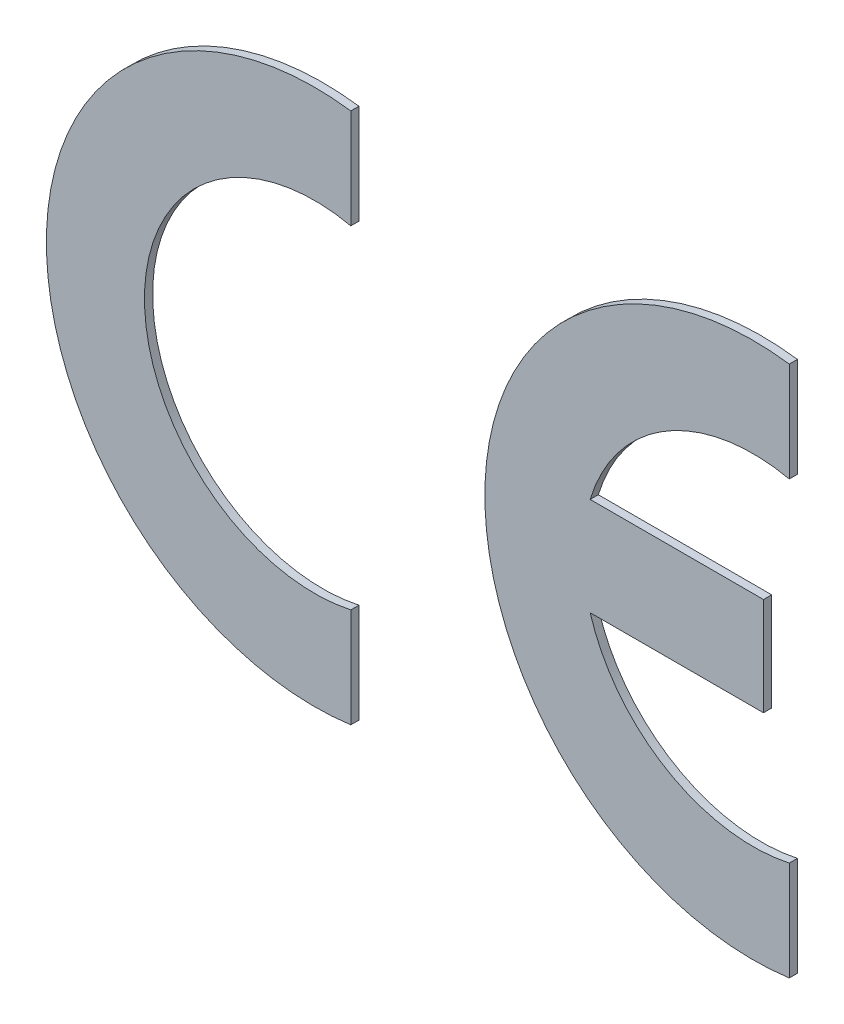
ISO-10303-21;
HEADER;
FILE_DESCRIPTION(('STEP AP214'),'2;1');
FILE_NAME('part.step','',(''),(''),'','','');
FILE_SCHEMA(('AUTOMOTIVE_DESIGN { 1 0 10303 214 1 1 1 1 }'));
ENDSEC;
DATA;
#1=APPLICATION_CONTEXT('core data for automotive mechanical design processes');
#2=APPLICATION_PROTOCOL_DEFINITION('international standard','automotive_design',2000,#1);
#3=PRODUCT_CONTEXT('',#1,'mechanical');
#4=PRODUCT('Part','Part','',(#3));
#5=PRODUCT_RELATED_PRODUCT_CATEGORY('part','',(#4));
#6=PRODUCT_DEFINITION_FORMATION('','',#4);
#7=PRODUCT_DEFINITION_CONTEXT('part definition',#1,'design');
#8=PRODUCT_DEFINITION('design','',#6,#7);
#9=PRODUCT_DEFINITION_SHAPE('','',#8);
#10=(LENGTH_UNIT() NAMED_UNIT(*) SI_UNIT(.MILLI.,.METRE.));
#11=(NAMED_UNIT(*) PLANE_ANGLE_UNIT() SI_UNIT($,.RADIAN.));
#12=(NAMED_UNIT(*) SI_UNIT($,.STERADIAN.) SOLID_ANGLE_UNIT());
#13=UNCERTAINTY_MEASURE_WITH_UNIT(LENGTH_MEASURE(1.E-05),#10,'distance_accuracy_value','');
#14=(GEOMETRIC_REPRESENTATION_CONTEXT(3) GLOBAL_UNCERTAINTY_ASSIGNED_CONTEXT((#13)) GLOBAL_UNIT_ASSIGNED_CONTEXT((#10,
#11,#12)) REPRESENTATION_CONTEXT('',''));
#15=CARTESIAN_POINT('',(0.,0.,0.));
#16=DIRECTION('',(0.,0.,1.));
#17=DIRECTION('',(1.,0.,0.));
#18=AXIS2_PLACEMENT_3D('',#15,#16,#17);
#19=CARTESIAN_POINT('',(0.,0.,0.05));
#20=DIRECTION('',(0.,0.,1.));
#21=DIRECTION('',(1.,0.,0.));
#22=AXIS2_PLACEMENT_3D('',#19,#20,#21);
#23=PLANE('',#22);
#24=DIRECTION('',(0.,1.,0.));
#25=VECTOR('',#24,1.);
#26=CARTESIAN_POINT('',(-0.546694,1.047073831881,0.05));
#27=LINE('',#26,#25);
#28=CARTESIAN_POINT('',(-0.546694,1.047073831881,0.05));
#29=VERTEX_POINT('',#28);
#30=CARTESIAN_POINT('',(-0.546694,1.657166865179,0.05));
#31=VERTEX_POINT('',#30);
#32=EDGE_CURVE('P0_E11',#29,#31,#27,.T.);
#33=ORIENTED_EDGE('',*,*,#32,.T.);
#34=CARTESIAN_POINT('',(-0.7682893867849,0.0277175,0.05));
#35=DIRECTION('',(0.,0.,1.));
#36=DIRECTION('',(0.134753646997806,0.990879132195643,0.));
#37=AXIS2_PLACEMENT_3D('',#34,#35,#36);
#38=CIRCLE('',#37,1.644448159452);
#39=CARTESIAN_POINT('',(-0.546694,-1.601731865179,0.05));
#40=VERTEX_POINT('',#39);
#41=EDGE_CURVE('P0_E83',#31,#40,#38,.T.);
#42=ORIENTED_EDGE('',*,*,#41,.T.);
#43=DIRECTION('',(0.,1.,0.));
#44=VECTOR('',#43,1.);
#45=CARTESIAN_POINT('',(-0.546694,-1.601731865179,0.05));
#46=LINE('',#45,#44);
#47=CARTESIAN_POINT('',(-0.546694,-0.9916378318808,0.05));
#48=VERTEX_POINT('',#47);
#49=EDGE_CURVE('P0_E21',#40,#48,#46,.T.);
#50=ORIENTED_EDGE('',*,*,#49,.T.);
#51=CARTESIAN_POINT('',(-0.7682882978671,0.027718,0.05));
#52=DIRECTION('',(0.,0.,-1.));
#53=DIRECTION('',(0.212425254228403,-0.977177318282613,0.));
#54=AXIS2_PLACEMENT_3D('',#51,#52,#53);
#55=CIRCLE('',#54,1.043163623233);
#56=EDGE_CURVE('P0_E101',#48,#29,#55,.T.);
#57=ORIENTED_EDGE('',*,*,#56,.T.);
#58=EDGE_LOOP('',(#33,#42,#50,#57));
#59=FACE_BOUND('',#58,.T.);
#60=ADVANCED_FACE('P0_F17',(#59),#23,.T.);
#61=CARTESIAN_POINT('',(-0.546694,1.047073831881,0.));
#62=DIRECTION('',(1.,0.,0.));
#63=DIRECTION('',(0.,1.,0.));
#64=AXIS2_PLACEMENT_3D('',#61,#62,#63);
#65=PLANE('',#64);
#66=DIRECTION('',(0.,0.,1.));
#67=VECTOR('',#66,1.);
#68=CARTESIAN_POINT('',(-0.546694,1.657166865179,0.));
#69=LINE('',#68,#67);
#70=CARTESIAN_POINT('',(-0.546694,1.657166865179,0.));
#71=VERTEX_POINT('',#70);
#72=EDGE_CURVE('P0_E28',#71,#31,#69,.T.);
#73=ORIENTED_EDGE('',*,*,#72,.T.);
#74=ORIENTED_EDGE('',*,*,#32,.F.);
#75=DIRECTION('',(0.,0.,1.));
#76=VECTOR('',#75,1.);
#77=CARTESIAN_POINT('',(-0.546694,1.047073831881,0.));
#78=LINE('',#77,#76);
#79=CARTESIAN_POINT('',(-0.546694,1.047073831881,0.));
#80=VERTEX_POINT('',#79);
#81=EDGE_CURVE('P0_E104',#80,#29,#78,.T.);
#82=ORIENTED_EDGE('',*,*,#81,.F.);
#83=DIRECTION('',(0.,1.,0.));
#84=VECTOR('',#83,1.);
#85=CARTESIAN_POINT('',(-0.546694,1.047073831881,0.));
#86=LINE('',#85,#84);
#87=EDGE_CURVE('P0_E92',#80,#71,#86,.T.);
#88=ORIENTED_EDGE('',*,*,#87,.T.);
#89=EDGE_LOOP('',(#73,#74,#82,#88));
#90=FACE_BOUND('',#89,.T.);
#91=ADVANCED_FACE('P0_F124',(#90),#65,.T.);
#92=CARTESIAN_POINT('',(-0.7682893867849,0.0277175,0.));
#93=DIRECTION('',(0.,0.,1.));
#94=DIRECTION('',(1.,0.,0.));
#95=AXIS2_PLACEMENT_3D('',#92,#93,#94);
#96=CYLINDRICAL_SURFACE('',#95,1.644448159452);
#97=DIRECTION('',(0.,0.,1.));
#98=VECTOR('',#97,1.);
#99=CARTESIAN_POINT('',(-0.546694,-1.601731865179,0.));
#100=LINE('',#99,#98);
#101=CARTESIAN_POINT('',(-0.546694,-1.601731865179,0.));
#102=VERTEX_POINT('',#101);
#103=EDGE_CURVE('P0_E75',#102,#40,#100,.T.);
#104=ORIENTED_EDGE('',*,*,#103,.T.);
#105=ORIENTED_EDGE('',*,*,#41,.F.);
#106=ORIENTED_EDGE('',*,*,#72,.F.);
#107=CARTESIAN_POINT('',(-0.7682893867849,0.0277175,0.));
#108=DIRECTION('',(0.,0.,1.));
#109=DIRECTION('',(0.134753646997806,0.990879132195643,0.));
#110=AXIS2_PLACEMENT_3D('',#107,#108,#109);
#111=CIRCLE('',#110,1.644448159452);
#112=EDGE_CURVE('P0_E86',#71,#102,#111,.T.);
#113=ORIENTED_EDGE('',*,*,#112,.T.);
#114=EDGE_LOOP('',(#104,#105,#106,#113));
#115=FACE_BOUND('',#114,.T.);
#116=ADVANCED_FACE('P0_F87',(#115),#96,.T.);
#117=CARTESIAN_POINT('',(-0.546694,-1.601731865179,0.));
#118=DIRECTION('',(1.,0.,0.));
#119=DIRECTION('',(0.,1.,0.));
#120=AXIS2_PLACEMENT_3D('',#117,#118,#119);
#121=PLANE('',#120);
#122=DIRECTION('',(0.,0.,1.));
#123=VECTOR('',#122,1.);
#124=CARTESIAN_POINT('',(-0.546694,-0.9916378318808,0.));
#125=LINE('',#124,#123);
#126=CARTESIAN_POINT('',(-0.546694,-0.9916378318808,0.));
#127=VERTEX_POINT('',#126);
#128=EDGE_CURVE('P0_E66',#127,#48,#125,.T.);
#129=ORIENTED_EDGE('',*,*,#128,.T.);
#130=ORIENTED_EDGE('',*,*,#49,.F.);
#131=ORIENTED_EDGE('',*,*,#103,.F.);
#132=DIRECTION('',(0.,1.,0.));
#133=VECTOR('',#132,1.);
#134=CARTESIAN_POINT('',(-0.546694,-1.601731865179,0.));
#135=LINE('',#134,#133);
#136=EDGE_CURVE('P0_E79',#102,#127,#135,.T.);
#137=ORIENTED_EDGE('',*,*,#136,.T.);
#138=EDGE_LOOP('',(#129,#130,#131,#137));
#139=FACE_BOUND('',#138,.T.);
#140=ADVANCED_FACE('P0_F77',(#139),#121,.T.);
#141=CARTESIAN_POINT('',(-0.7682882978671,0.027718,0.));
#142=DIRECTION('',(0.,0.,1.));
#143=DIRECTION('',(1.,0.,0.));
#144=AXIS2_PLACEMENT_3D('',#141,#142,#143);
#145=CYLINDRICAL_SURFACE('',#144,1.043163623233);
#146=ORIENTED_EDGE('',*,*,#81,.T.);
#147=ORIENTED_EDGE('',*,*,#56,.F.);
#148=ORIENTED_EDGE('',*,*,#128,.F.);
#149=CARTESIAN_POINT('',(-0.7682882978671,0.027718,0.));
#150=DIRECTION('',(0.,0.,-1.));
#151=DIRECTION('',(0.212425254228403,-0.977177318282613,0.));
#152=AXIS2_PLACEMENT_3D('',#149,#150,#151);
#153=CIRCLE('',#152,1.043163623233);
#154=EDGE_CURVE('P0_E94',#127,#80,#153,.T.);
#155=ORIENTED_EDGE('',*,*,#154,.T.);
#156=EDGE_LOOP('',(#146,#147,#148,#155));
#157=FACE_BOUND('',#156,.T.);
#158=ADVANCED_FACE('P0_F122',(#157),#145,.F.);
#159=CARTESIAN_POINT('',(0.,0.,0.));
#160=DIRECTION('',(0.,0.,1.));
#161=DIRECTION('',(1.,0.,0.));
#162=AXIS2_PLACEMENT_3D('',#159,#160,#161);
#163=PLANE('',#162);
#164=ORIENTED_EDGE('',*,*,#136,.F.);
#165=ORIENTED_EDGE('',*,*,#112,.F.);
#166=ORIENTED_EDGE('',*,*,#87,.F.);
#167=ORIENTED_EDGE('',*,*,#154,.F.);
#168=EDGE_LOOP('',(#164,#165,#166,#167));
#169=FACE_BOUND('',#168,.T.);
#170=ADVANCED_FACE('P0_F19',(#169),#163,.F.);
#171=CLOSED_SHELL('',(#60,#91,#116,#140,#158,#170));
#172=MANIFOLD_SOLID_BREP('P0_B1',#171);
#173=CARTESIAN_POINT('',(2.140918,1.047073838484,0.));
#174=DIRECTION('',(1.,0.,0.));
#175=DIRECTION('',(0.,1.,0.));
#176=AXIS2_PLACEMENT_3D('',#173,#174,#175);
#177=PLANE('',#176);
#178=DIRECTION('',(0.,0.,1.));
#179=VECTOR('',#178,1.);
#180=CARTESIAN_POINT('',(2.140918,1.657166865179,0.));
#181=LINE('',#180,#179);
#182=CARTESIAN_POINT('',(2.140918,1.657166865179,0.));
#183=VERTEX_POINT('',#182);
#184=CARTESIAN_POINT('',(2.140918,1.657166865179,0.05));
#185=VERTEX_POINT('',#184);
#186=EDGE_CURVE('P1_E11',#183,#185,#181,.T.);
#187=ORIENTED_EDGE('',*,*,#186,.T.);
#188=DIRECTION('',(0.,1.,0.));
#189=VECTOR('',#188,1.);
#190=CARTESIAN_POINT('',(2.140918,1.047073838484,0.05));
#191=LINE('',#190,#189);
#192=CARTESIAN_POINT('',(2.140918,1.047073838484,0.05));
#193=VERTEX_POINT('',#192);
#194=EDGE_CURVE('P1_E153',#193,#185,#191,.T.);
#195=ORIENTED_EDGE('',*,*,#194,.F.);
#196=DIRECTION('',(0.,0.,1.));
#197=VECTOR('',#196,1.);
#198=CARTESIAN_POINT('',(2.140918,1.047073838484,0.));
#199=LINE('',#198,#197);
#200=CARTESIAN_POINT('',(2.140918,1.047073838484,0.));
#201=VERTEX_POINT('',#200);
#202=EDGE_CURVE('P1_E179',#201,#193,#199,.T.);
#203=ORIENTED_EDGE('',*,*,#202,.F.);
#204=DIRECTION('',(0.,1.,0.));
#205=VECTOR('',#204,1.);
#206=CARTESIAN_POINT('',(2.140918,1.047073838484,0.));
#207=LINE('',#206,#205);
#208=EDGE_CURVE('P1_E135',#201,#183,#207,.T.);
#209=ORIENTED_EDGE('',*,*,#208,.T.);
#210=EDGE_LOOP('',(#187,#195,#203,#209));
#211=FACE_BOUND('',#210,.T.);
#212=ADVANCED_FACE('P1_F17',(#211),#177,.T.);
#213=CARTESIAN_POINT('',(1.919322613215,0.0277175,0.));
#214=DIRECTION('',(0.,0.,1.));
#215=DIRECTION('',(1.,0.,0.));
#216=AXIS2_PLACEMENT_3D('',#213,#214,#215);
#217=CYLINDRICAL_SURFACE('',#216,1.644448159452);
#218=DIRECTION('',(0.,0.,1.));
#219=VECTOR('',#218,1.);
#220=CARTESIAN_POINT('',(2.140918,-1.601731865179,0.));
#221=LINE('',#220,#219);
#222=CARTESIAN_POINT('',(2.140918,-1.601731865179,0.));
#223=VERTEX_POINT('',#222);
#224=CARTESIAN_POINT('',(2.140918,-1.601731865179,0.05));
#225=VERTEX_POINT('',#224);
#226=EDGE_CURVE('P1_E27',#223,#225,#221,.T.);
#227=ORIENTED_EDGE('',*,*,#226,.T.);
#228=CARTESIAN_POINT('',(1.919322613215,0.0277175,0.05));
#229=DIRECTION('',(0.,0.,1.));
#230=DIRECTION('',(0.134753646997806,0.990879132195643,0.));
#231=AXIS2_PLACEMENT_3D('',#228,#229,#230);
#232=CIRCLE('',#231,1.644448159452);
#233=EDGE_CURVE('P1_E152',#185,#225,#232,.T.);
#234=ORIENTED_EDGE('',*,*,#233,.F.);
#235=ORIENTED_EDGE('',*,*,#186,.F.);
#236=CARTESIAN_POINT('',(1.919322613215,0.0277175,0.));
#237=DIRECTION('',(0.,0.,1.));
#238=DIRECTION('',(0.134753646997806,0.990879132195643,0.));
#239=AXIS2_PLACEMENT_3D('',#236,#237,#238);
#240=CIRCLE('',#239,1.644448159452);
#241=EDGE_CURVE('P1_E131',#183,#223,#240,.T.);
#242=ORIENTED_EDGE('',*,*,#241,.T.);
#243=EDGE_LOOP('',(#227,#234,#235,#242));
#244=FACE_BOUND('',#243,.T.);
#245=ADVANCED_FACE('P1_F19',(#244),#217,.T.);
#246=CARTESIAN_POINT('',(2.140918,-1.601731865179,0.));
#247=DIRECTION('',(1.,0.,0.));
#248=DIRECTION('',(0.,1.,0.));
#249=AXIS2_PLACEMENT_3D('',#246,#247,#248);
#250=PLANE('',#249);
#251=DIRECTION('',(0.,0.,1.));
#252=VECTOR('',#251,1.);
#253=CARTESIAN_POINT('',(2.140918,-0.9916375604768,0.));
#254=LINE('',#253,#252);
#255=CARTESIAN_POINT('',(2.140918,-0.9916375604768,0.));
#256=VERTEX_POINT('',#255);
#257=CARTESIAN_POINT('',(2.140918,-0.9916375604768,0.05));
#258=VERTEX_POINT('',#257);
#259=EDGE_CURVE('P1_E128',#256,#258,#254,.T.);
#260=ORIENTED_EDGE('',*,*,#259,.T.);
#261=DIRECTION('',(0.,1.,0.));
#262=VECTOR('',#261,1.);
#263=CARTESIAN_POINT('',(2.140918,-1.601731865179,0.05));
#264=LINE('',#263,#262);
#265=EDGE_CURVE('P1_E125',#225,#258,#264,.T.);
#266=ORIENTED_EDGE('',*,*,#265,.F.);
#267=ORIENTED_EDGE('',*,*,#226,.F.);
#268=DIRECTION('',(0.,1.,0.));
#269=VECTOR('',#268,1.);
#270=CARTESIAN_POINT('',(2.140918,-1.601731865179,0.));
#271=LINE('',#270,#269);
#272=EDGE_CURVE('P1_E122',#223,#256,#271,.T.);
#273=ORIENTED_EDGE('',*,*,#272,.T.);
#274=EDGE_LOOP('',(#260,#266,#267,#273));
#275=FACE_BOUND('',#274,.T.);
#276=ADVANCED_FACE('P1_F120',(#275),#250,.T.);
#277=CARTESIAN_POINT('',(1.91932029307,0.02771576818233,0.));
#278=DIRECTION('',(0.,0.,1.));
#279=DIRECTION('',(1.,0.,0.));
#280=AXIS2_PLACEMENT_3D('',#277,#278,#279);
#281=CYLINDRICAL_SURFACE('',#280,1.04316190132);
#282=DIRECTION('',(0.,0.,1.));
#283=VECTOR('',#282,1.);
#284=CARTESIAN_POINT('',(0.920420258237,-0.272926,0.));
#285=LINE('',#284,#283);
#286=CARTESIAN_POINT('',(0.920420258237,-0.272926,0.));
#287=VERTEX_POINT('',#286);
#288=CARTESIAN_POINT('',(0.920420258237,-0.272926,0.05));
#289=VERTEX_POINT('',#288);
#290=EDGE_CURVE('P1_E53',#287,#289,#285,.T.);
#291=ORIENTED_EDGE('',*,*,#290,.T.);
#292=CARTESIAN_POINT('',(1.91932029307,0.02771576818233,0.05));
#293=DIRECTION('',(0.,0.,-1.));
#294=DIRECTION('',(0.212428872881193,-0.977176531628971,0.));
#295=AXIS2_PLACEMENT_3D('',#292,#293,#294);
#296=CIRCLE('',#295,1.04316190132);
#297=EDGE_CURVE('P1_E157',#258,#289,#296,.T.);
#298=ORIENTED_EDGE('',*,*,#297,.F.);
#299=ORIENTED_EDGE('',*,*,#259,.F.);
#300=CARTESIAN_POINT('',(1.91932029307,0.02771576818233,0.));
#301=DIRECTION('',(0.,0.,-1.));
#302=DIRECTION('',(0.212428872881193,-0.977176531628971,0.));
#303=AXIS2_PLACEMENT_3D('',#300,#301,#302);
#304=CIRCLE('',#303,1.04316190132);
#305=EDGE_CURVE('P1_E139',#256,#287,#304,.T.);
#306=ORIENTED_EDGE('',*,*,#305,.T.);
#307=EDGE_LOOP('',(#291,#298,#299,#306));
#308=FACE_BOUND('',#307,.T.);
#309=ADVANCED_FACE('P1_F219',(#308),#281,.F.);
#310=CARTESIAN_POINT('',(0.920420258237,-0.272926,0.));
#311=DIRECTION('',(0.,-1.,0.));
#312=DIRECTION('',(0.,0.,-1.));
#313=AXIS2_PLACEMENT_3D('',#310,#311,#312);
#314=PLANE('',#313);
#315=DIRECTION('',(0.,0.,1.));
#316=VECTOR('',#315,1.);
#317=CARTESIAN_POINT('',(1.982823,-0.272926,0.));
#318=LINE('',#317,#316);
#319=CARTESIAN_POINT('',(1.982823,-0.272926,0.));
#320=VERTEX_POINT('',#319);
#321=CARTESIAN_POINT('',(1.982823,-0.272926,0.05));
#322=VERTEX_POINT('',#321);
#323=EDGE_CURVE('P1_E40',#320,#322,#318,.T.);
#324=ORIENTED_EDGE('',*,*,#323,.T.);
#325=DIRECTION('',(1.,0.,0.));
#326=VECTOR('',#325,1.);
#327=CARTESIAN_POINT('',(0.920420258237,-0.272926,0.05));
#328=LINE('',#327,#326);
#329=EDGE_CURVE('P1_E158',#289,#322,#328,.T.);
#330=ORIENTED_EDGE('',*,*,#329,.F.);
#331=ORIENTED_EDGE('',*,*,#290,.F.);
#332=DIRECTION('',(1.,0.,0.));
#333=VECTOR('',#332,1.);
#334=CARTESIAN_POINT('',(0.920420258237,-0.272926,0.));
#335=LINE('',#334,#333);
#336=EDGE_CURVE('P1_E148',#287,#320,#335,.T.);
#337=ORIENTED_EDGE('',*,*,#336,.T.);
#338=EDGE_LOOP('',(#324,#330,#331,#337));
#339=FACE_BOUND('',#338,.T.);
#340=ADVANCED_FACE('P1_F220',(#339),#314,.T.);
#341=CARTESIAN_POINT('',(1.982823,-0.272926,0.));
#342=DIRECTION('',(1.,0.,0.));
#343=DIRECTION('',(0.,1.,0.));
#344=AXIS2_PLACEMENT_3D('',#341,#342,#343);
#345=PLANE('',#344);
#346=DIRECTION('',(0.,0.,1.));
#347=VECTOR('',#346,1.);
#348=CARTESIAN_POINT('',(1.982823,0.328359,0.));
#349=LINE('',#348,#347);
#350=CARTESIAN_POINT('',(1.982823,0.328359,0.));
#351=VERTEX_POINT('',#350);
#352=CARTESIAN_POINT('',(1.982823,0.328359,0.05));
#353=VERTEX_POINT('',#352);
#354=EDGE_CURVE('P1_E184',#351,#353,#349,.T.);
#355=ORIENTED_EDGE('',*,*,#354,.T.);
#356=DIRECTION('',(0.,1.,0.));
#357=VECTOR('',#356,1.);
#358=CARTESIAN_POINT('',(1.982823,-0.272926,0.05));
#359=LINE('',#358,#357);
#360=EDGE_CURVE('P1_E162',#322,#353,#359,.T.);
#361=ORIENTED_EDGE('',*,*,#360,.F.);
#362=ORIENTED_EDGE('',*,*,#323,.F.);
#363=DIRECTION('',(0.,1.,0.));
#364=VECTOR('',#363,1.);
#365=CARTESIAN_POINT('',(1.982823,-0.272926,0.));
#366=LINE('',#365,#364);
#367=EDGE_CURVE('P1_E110',#320,#351,#366,.T.);
#368=ORIENTED_EDGE('',*,*,#367,.T.);
#369=EDGE_LOOP('',(#355,#361,#362,#368));
#370=FACE_BOUND('',#369,.T.);
#371=ADVANCED_FACE('P1_F373',(#370),#345,.T.);
#372=CARTESIAN_POINT('',(0.,0.,0.05));
#373=DIRECTION('',(0.,0.,1.));
#374=DIRECTION('',(1.,0.,0.));
#375=AXIS2_PLACEMENT_3D('',#372,#373,#374);
#376=PLANE('',#375);
#377=ORIENTED_EDGE('',*,*,#194,.T.);
#378=ORIENTED_EDGE('',*,*,#233,.T.);
#379=ORIENTED_EDGE('',*,*,#265,.T.);
#380=ORIENTED_EDGE('',*,*,#297,.T.);
#381=ORIENTED_EDGE('',*,*,#329,.T.);
#382=ORIENTED_EDGE('',*,*,#360,.T.);
#383=DIRECTION('',(-1.,0.,0.));
#384=VECTOR('',#383,1.);
#385=CARTESIAN_POINT('',(1.982823,0.328359,0.05));
#386=LINE('',#385,#384);
#387=CARTESIAN_POINT('',(0.9204202566082,0.328359,0.05));
#388=VERTEX_POINT('',#387);
#389=EDGE_CURVE('P1_E167',#353,#388,#386,.T.);
#390=ORIENTED_EDGE('',*,*,#389,.T.);
#391=CARTESIAN_POINT('',(1.919323509045,0.02771641749802,0.05));
#392=DIRECTION('',(0.,0.,-1.));
#393=DIRECTION('',(-0.957569554729989,0.288202268995596,0.));
#394=AXIS2_PLACEMENT_3D('',#391,#392,#393);
#395=CIRCLE('',#394,1.043165217088);
#396=EDGE_CURVE('P1_E175',#388,#193,#395,.T.);
#397=ORIENTED_EDGE('',*,*,#396,.T.);
#398=EDGE_LOOP('',(#377,#378,#379,#380,#381,#382,#390,#397));
#399=FACE_BOUND('',#398,.T.);
#400=ADVANCED_FACE('P1_F207',(#399),#376,.T.);
#401=CARTESIAN_POINT('',(1.919323509045,0.02771641749802,0.));
#402=DIRECTION('',(0.,0.,1.));
#403=DIRECTION('',(1.,0.,0.));
#404=AXIS2_PLACEMENT_3D('',#401,#402,#403);
#405=CYLINDRICAL_SURFACE('',#404,1.043165217088);
#406=ORIENTED_EDGE('',*,*,#202,.T.);
#407=ORIENTED_EDGE('',*,*,#396,.F.);
#408=DIRECTION('',(0.,0.,1.));
#409=VECTOR('',#408,1.);
#410=CARTESIAN_POINT('',(0.9204202566082,0.328359,0.));
#411=LINE('',#410,#409);
#412=CARTESIAN_POINT('',(0.9204202566082,0.328359,0.));
#413=VERTEX_POINT('',#412);
#414=EDGE_CURVE('P1_E163',#413,#388,#411,.T.);
#415=ORIENTED_EDGE('',*,*,#414,.F.);
#416=CARTESIAN_POINT('',(1.919323509045,0.02771641749802,0.));
#417=DIRECTION('',(0.,0.,-1.));
#418=DIRECTION('',(-0.957569554729989,0.288202268995596,0.));
#419=AXIS2_PLACEMENT_3D('',#416,#417,#418);
#420=CIRCLE('',#419,1.043165217088);
#421=EDGE_CURVE('P1_E183',#413,#201,#420,.T.);
#422=ORIENTED_EDGE('',*,*,#421,.T.);
#423=EDGE_LOOP('',(#406,#407,#415,#422));
#424=FACE_BOUND('',#423,.T.);
#425=ADVANCED_FACE('P1_F214',(#424),#405,.F.);
#426=CARTESIAN_POINT('',(0.,0.,0.));
#427=DIRECTION('',(0.,0.,1.));
#428=DIRECTION('',(1.,0.,0.));
#429=AXIS2_PLACEMENT_3D('',#426,#427,#428);
#430=PLANE('',#429);
#431=DIRECTION('',(-1.,0.,0.));
#432=VECTOR('',#431,1.);
#433=CARTESIAN_POINT('',(1.982823,0.328359,0.));
#434=LINE('',#433,#432);
#435=EDGE_CURVE('P1_E21',#351,#413,#434,.T.);
#436=ORIENTED_EDGE('',*,*,#435,.F.);
#437=ORIENTED_EDGE('',*,*,#367,.F.);
#438=ORIENTED_EDGE('',*,*,#336,.F.);
#439=ORIENTED_EDGE('',*,*,#305,.F.);
#440=ORIENTED_EDGE('',*,*,#272,.F.);
#441=ORIENTED_EDGE('',*,*,#241,.F.);
#442=ORIENTED_EDGE('',*,*,#208,.F.);
#443=ORIENTED_EDGE('',*,*,#421,.F.);
#444=EDGE_LOOP('',(#436,#437,#438,#439,#440,#441,#442,#443));
#445=FACE_BOUND('',#444,.T.);
#446=ADVANCED_FACE('P1_F137',(#445),#430,.F.);
#447=CARTESIAN_POINT('',(1.982823,0.328359,0.));
#448=DIRECTION('',(0.,1.,0.));
#449=DIRECTION('',(1.,0.,0.));
#450=AXIS2_PLACEMENT_3D('',#447,#448,#449);
#451=PLANE('',#450);
#452=ORIENTED_EDGE('',*,*,#414,.T.);
#453=ORIENTED_EDGE('',*,*,#389,.F.);
#454=ORIENTED_EDGE('',*,*,#354,.F.);
#455=ORIENTED_EDGE('',*,*,#435,.T.);
#456=EDGE_LOOP('',(#452,#453,#454,#455));
#457=FACE_BOUND('',#456,.T.);
#458=ADVANCED_FACE('P1_F212',(#457),#451,.T.);
#459=CLOSED_SHELL('',(#212,#245,#276,#309,#340,#371,#400,#425,#446,#458));
#460=MANIFOLD_SOLID_BREP('P1_B1',#459);
#461=ADVANCED_BREP_SHAPE_REPRESENTATION('',(#18,#172,#460),#14);
#462=SHAPE_DEFINITION_REPRESENTATION(#9,#461);
ENDSEC;
END-ISO-10303-21;
